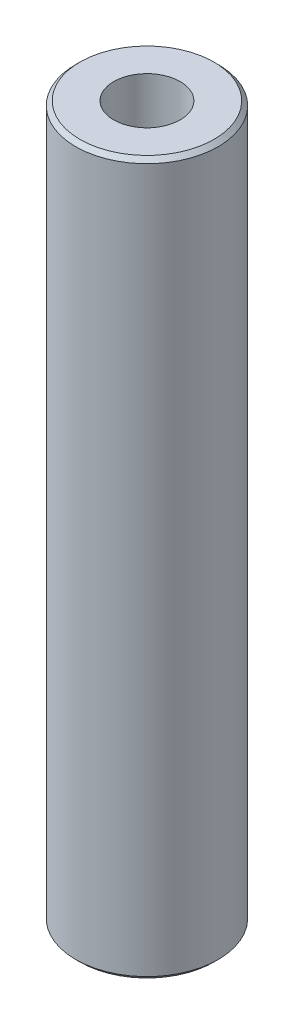
ISO-10303-21;
HEADER;
FILE_DESCRIPTION(('STEP AP214'),'2;1');
FILE_NAME('part.step','',(''),(''),'','','');
FILE_SCHEMA(('AUTOMOTIVE_DESIGN { 1 0 10303 214 1 1 1 1 }'));
ENDSEC;
DATA;
#1=APPLICATION_CONTEXT('core data for automotive mechanical design processes');
#2=APPLICATION_PROTOCOL_DEFINITION('international standard','automotive_design',2000,#1);
#3=PRODUCT_CONTEXT('',#1,'mechanical');
#4=PRODUCT('Part','Part','',(#3));
#5=PRODUCT_RELATED_PRODUCT_CATEGORY('part','',(#4));
#6=PRODUCT_DEFINITION_FORMATION('','',#4);
#7=PRODUCT_DEFINITION_CONTEXT('part definition',#1,'design');
#8=PRODUCT_DEFINITION('design','',#6,#7);
#9=PRODUCT_DEFINITION_SHAPE('','',#8);
#10=(LENGTH_UNIT() NAMED_UNIT(*) SI_UNIT(.MILLI.,.METRE.));
#11=(NAMED_UNIT(*) PLANE_ANGLE_UNIT() SI_UNIT($,.RADIAN.));
#12=(NAMED_UNIT(*) SI_UNIT($,.STERADIAN.) SOLID_ANGLE_UNIT());
#13=UNCERTAINTY_MEASURE_WITH_UNIT(LENGTH_MEASURE(1.E-05),#10,'distance_accuracy_value','');
#14=(GEOMETRIC_REPRESENTATION_CONTEXT(3) GLOBAL_UNCERTAINTY_ASSIGNED_CONTEXT((#13)) GLOBAL_UNIT_ASSIGNED_CONTEXT((#10,
#11,#12)) REPRESENTATION_CONTEXT('',''));
#15=CARTESIAN_POINT('',(0.,0.,0.));
#16=DIRECTION('',(0.,0.,1.));
#17=DIRECTION('',(1.,0.,0.));
#18=AXIS2_PLACEMENT_3D('',#15,#16,#17);
#19=CARTESIAN_POINT('',(0.,600.,0.));
#20=DIRECTION('',(0.,-1.,0.));
#21=DIRECTION('',(0.,0.,-1.));
#22=AXIS2_PLACEMENT_3D('',#19,#20,#21);
#23=CYLINDRICAL_SURFACE('',#22,60.);
#24=CARTESIAN_POINT('',(0.,596.452487027661,0.));
#25=DIRECTION('',(0.,1.,0.));
#26=DIRECTION('',(0.,0.,1.));
#27=AXIS2_PLACEMENT_3D('',#24,#25,#26);
#28=CIRCLE('',#27,60.);
#29=CARTESIAN_POINT('',(0.,596.452487027661,60.));
#30=VERTEX_POINT('',#29);
#31=EDGE_CURVE('E50',#30,#30,#28,.F.);
#32=ORIENTED_EDGE('',*,*,#31,.T.);
#33=EDGE_LOOP('',(#32));
#34=FACE_BOUND('',#33,.T.);
#35=CARTESIAN_POINT('',(0.,3.54751297233902,0.));
#36=DIRECTION('',(0.,1.,0.));
#37=DIRECTION('',(0.,0.,1.));
#38=AXIS2_PLACEMENT_3D('',#35,#36,#37);
#39=CIRCLE('',#38,60.);
#40=CARTESIAN_POINT('',(0.,3.54751297233902,60.));
#41=VERTEX_POINT('',#40);
#42=EDGE_CURVE('E51',#41,#41,#39,.T.);
#43=ORIENTED_EDGE('',*,*,#42,.T.);
#44=EDGE_LOOP('',(#43));
#45=FACE_BOUND('',#44,.T.);
#46=ADVANCED_FACE('F39',(#34,#45),#23,.T.);
#47=CARTESIAN_POINT('',(0.,600.,0.));
#48=DIRECTION('',(0.,1.,0.));
#49=DIRECTION('',(0.,0.,1.));
#50=AXIS2_PLACEMENT_3D('',#47,#48,#49);
#51=PLANE('',#50);
#52=CARTESIAN_POINT('',(0.,600.,0.));
#53=DIRECTION('',(0.,1.,0.));
#54=DIRECTION('',(0.,0.,1.));
#55=AXIS2_PLACEMENT_3D('',#52,#53,#54);
#56=CIRCLE('',#55,56.4524870276609);
#57=CARTESIAN_POINT('',(0.,600.,56.4524870276609));
#58=VERTEX_POINT('',#57);
#59=EDGE_CURVE('E54',#58,#58,#56,.T.);
#60=ORIENTED_EDGE('',*,*,#59,.T.);
#61=EDGE_LOOP('',(#60));
#62=FACE_BOUND('',#61,.T.);
#63=CARTESIAN_POINT('',(0.,600.,0.));
#64=DIRECTION('',(0.,1.,0.));
#65=DIRECTION('',(0.,0.,1.));
#66=AXIS2_PLACEMENT_3D('',#63,#64,#65);
#67=CIRCLE('',#66,27.9817754680077);
#68=CARTESIAN_POINT('',(0.,600.,27.9817754680077));
#69=VERTEX_POINT('',#68);
#70=EDGE_CURVE('E58',#69,#69,#67,.T.);
#71=ORIENTED_EDGE('',*,*,#70,.F.);
#72=EDGE_LOOP('',(#71));
#73=FACE_BOUND('',#72,.T.);
#74=ADVANCED_FACE('F69',(#62,#73),#51,.T.);
#75=CARTESIAN_POINT('',(0.,0.,0.));
#76=DIRECTION('',(0.,1.,0.));
#77=DIRECTION('',(0.,0.,1.));
#78=AXIS2_PLACEMENT_3D('',#75,#76,#77);
#79=PLANE('',#78);
#80=CARTESIAN_POINT('',(0.,0.,0.));
#81=DIRECTION('',(0.,1.,0.));
#82=DIRECTION('',(0.,0.,1.));
#83=AXIS2_PLACEMENT_3D('',#80,#81,#82);
#84=CIRCLE('',#83,56.4524870276609);
#85=CARTESIAN_POINT('',(0.,0.,56.4524870276609));
#86=VERTEX_POINT('',#85);
#87=EDGE_CURVE('E10',#86,#86,#84,.F.);
#88=ORIENTED_EDGE('',*,*,#87,.T.);
#89=EDGE_LOOP('',(#88));
#90=FACE_BOUND('',#89,.T.);
#91=CARTESIAN_POINT('',(0.,0.,0.));
#92=DIRECTION('',(0.,1.,0.));
#93=DIRECTION('',(0.,0.,1.));
#94=AXIS2_PLACEMENT_3D('',#91,#92,#93);
#95=CIRCLE('',#94,27.9817754680077);
#96=CARTESIAN_POINT('',(0.,0.,27.9817754680077));
#97=VERTEX_POINT('',#96);
#98=EDGE_CURVE('E63',#97,#97,#95,.T.);
#99=ORIENTED_EDGE('',*,*,#98,.T.);
#100=EDGE_LOOP('',(#99));
#101=FACE_BOUND('',#100,.T.);
#102=ADVANCED_FACE('F75',(#90,#101),#79,.F.);
#103=CARTESIAN_POINT('',(0.,600.,0.));
#104=DIRECTION('',(0.,-1.,0.));
#105=DIRECTION('',(0.,0.,-1.));
#106=AXIS2_PLACEMENT_3D('',#103,#104,#105);
#107=CYLINDRICAL_SURFACE('',#106,27.9817754680077);
#108=ORIENTED_EDGE('',*,*,#70,.T.);
#109=EDGE_LOOP('',(#108));
#110=FACE_BOUND('',#109,.T.);
#111=ORIENTED_EDGE('',*,*,#98,.F.);
#112=EDGE_LOOP('',(#111));
#113=FACE_BOUND('',#112,.T.);
#114=ADVANCED_FACE('F70',(#110,#113),#107,.F.);
#115=CARTESIAN_POINT('',(0.,600.,0.));
#116=DIRECTION('',(0.,-1.,0.));
#117=DIRECTION('',(0.,0.,-1.));
#118=AXIS2_PLACEMENT_3D('',#115,#116,#117);
#119=CONICAL_SURFACE('',#118,56.4524870276609,0.785398163397441);
#120=ORIENTED_EDGE('',*,*,#31,.F.);
#121=EDGE_LOOP('',(#120));
#122=FACE_BOUND('',#121,.T.);
#123=ORIENTED_EDGE('',*,*,#59,.F.);
#124=EDGE_LOOP('',(#123));
#125=FACE_BOUND('',#124,.T.);
#126=ADVANCED_FACE('F81',(#122,#125),#119,.T.);
#127=CARTESIAN_POINT('',(0.,3.54751297233902,0.));
#128=DIRECTION('',(0.,1.,0.));
#129=DIRECTION('',(0.,0.,1.));
#130=AXIS2_PLACEMENT_3D('',#127,#128,#129);
#131=CONICAL_SURFACE('',#130,60.,0.785398163397456);
#132=CARTESIAN_POINT('',(0.,0.,56.4524870276609));
#133=CARTESIAN_POINT('',(0.,0.0369532601285301,56.4894402877895));
#134=CARTESIAN_POINT('',(0.,0.073906520257062,56.526393547918));
#135=CARTESIAN_POINT('',(0.,0.147813040514126,56.600300068175));
#136=CARTESIAN_POINT('',(0.,0.184766300642658,56.6372533283036));
#137=CARTESIAN_POINT('',(0.,0.25867282089972,56.7111598485606));
#138=CARTESIAN_POINT('',(0.,0.295626081028251,56.7481131086892));
#139=CARTESIAN_POINT('',(0.,0.369532601285313,56.8220196289462));
#140=CARTESIAN_POINT('',(0.,0.406485861413845,56.8589728890748));
#141=CARTESIAN_POINT('',(0.,0.480392381670908,56.9328794093318));
#142=CARTESIAN_POINT('',(0.,0.517345641799439,56.9698326694604));
#143=CARTESIAN_POINT('',(0.,0.591252162056503,57.0437391897174));
#144=CARTESIAN_POINT('',(0.,0.628205422185035,57.080692449846));
#145=CARTESIAN_POINT('',(0.,0.702111942442097,57.154598970103));
#146=CARTESIAN_POINT('',(0.,0.739065202570628,57.1915522302316));
#147=CARTESIAN_POINT('',(0.,0.81297172282769,57.2654587504886));
#148=CARTESIAN_POINT('',(0.,0.849924982956222,57.3024120106172));
#149=CARTESIAN_POINT('',(0.,0.923831503213286,57.3763185308742));
#150=CARTESIAN_POINT('',(0.,0.960784763341817,57.4132717910028));
#151=CARTESIAN_POINT('',(0.,1.03469128359888,57.4871783112598));
#152=CARTESIAN_POINT('',(0.,1.07164454372741,57.5241315713884));
#153=CARTESIAN_POINT('',(0.,1.14555106398447,57.5980380916454));
#154=CARTESIAN_POINT('',(0.,1.182504324113,57.6349913517739));
#155=CARTESIAN_POINT('',(0.,1.25641084437007,57.708897872031));
#156=CARTESIAN_POINT('',(0.,1.2933641044986,57.7458511321596));
#157=CARTESIAN_POINT('',(0.,1.36727062475566,57.8197576524166));
#158=CARTESIAN_POINT('',(0.,1.40422388488419,57.8567109125451));
#159=CARTESIAN_POINT('',(0.,1.47813040514126,57.9306174328022));
#160=CARTESIAN_POINT('',(0.,1.51508366526979,57.9675706929307));
#161=CARTESIAN_POINT('',(0.,1.58899018552685,58.0414772131878));
#162=CARTESIAN_POINT('',(0.,1.62594344565538,58.0784304733163));
#163=CARTESIAN_POINT('',(0.,1.69984996591244,58.1523369935734));
#164=CARTESIAN_POINT('',(0.,1.73680322604098,58.1892902537019));
#165=CARTESIAN_POINT('',(0.,1.81070974629804,58.263196773959));
#166=CARTESIAN_POINT('',(0.,1.84766300642657,58.3001500340875));
#167=CARTESIAN_POINT('',(0.,1.92156952668363,58.3740565543446));
#168=CARTESIAN_POINT('',(0.,1.95852278681217,58.4110098144731));
#169=CARTESIAN_POINT('',(0.,2.03242930706923,58.4849163347302));
#170=CARTESIAN_POINT('',(0.,2.06938256719776,58.5218695948587));
#171=CARTESIAN_POINT('',(0.,2.14328908745482,58.5957761151158));
#172=CARTESIAN_POINT('',(0.,2.18024234758335,58.6327293752443));
#173=CARTESIAN_POINT('',(0.,2.25414886784042,58.7066358955014));
#174=CARTESIAN_POINT('',(0.,2.29110212796895,58.7435891556299));
#175=CARTESIAN_POINT('',(0.,2.36500864822601,58.817495675887));
#176=CARTESIAN_POINT('',(0.,2.40196190835454,58.8544489360155));
#177=CARTESIAN_POINT('',(0.,2.47586842861161,58.9283554562726));
#178=CARTESIAN_POINT('',(0.,2.51282168874014,58.9653087164011));
#179=CARTESIAN_POINT('',(0.,2.5867282089972,59.0392152366582));
#180=CARTESIAN_POINT('',(0.,2.62368146912573,59.0761684967867));
#181=CARTESIAN_POINT('',(0.,2.69758798938279,59.1500750170438));
#182=CARTESIAN_POINT('',(0.,2.73454124951133,59.1870282771723));
#183=CARTESIAN_POINT('',(0.,2.80844776976839,59.2609347974293));
#184=CARTESIAN_POINT('',(0.,2.84540102989692,59.2978880575579));
#185=CARTESIAN_POINT('',(0.,2.91930755015398,59.371794577815));
#186=CARTESIAN_POINT('',(0.,2.95626081028251,59.4087478379435));
#187=CARTESIAN_POINT('',(0.,3.03016733053958,59.4826543582005));
#188=CARTESIAN_POINT('',(0.,3.06712059066811,59.5196076183291));
#189=CARTESIAN_POINT('',(0.,3.14102711092517,59.5935141385861));
#190=CARTESIAN_POINT('',(0.,3.1779803710537,59.6304673987147));
#191=CARTESIAN_POINT('',(0.,3.25188689131077,59.7043739189717));
#192=CARTESIAN_POINT('',(0.,3.2888401514393,59.7413271791003));
#193=CARTESIAN_POINT('',(0.,3.36274667169636,59.8152336993573));
#194=CARTESIAN_POINT('',(0.,3.39969993182489,59.8521869594859));
#195=CARTESIAN_POINT('',(0.,3.47360645208195,59.9260934797429));
#196=CARTESIAN_POINT('',(0.,3.51055971221048,59.9630467398715));
#197=CARTESIAN_POINT('',(0.,3.54751297233902,60.));
#198=B_SPLINE_CURVE_WITH_KNOTS('',3,(#132,#133,#134,#135,#136,#137,#138,#139,#140,#141,#142,
#143,#144,#145,#146,#147,#148,#149,#150,#151,#152,#153,#154,#155,#156,#157,#158,#159,#160,#161,
#162,#163,#164,#165,#166,#167,#168,#169,#170,#171,#172,#173,#174,#175,#176,#177,#178,#179,#180,
#181,#182,#183,#184,#185,#186,#187,#188,#189,#190,#191,#192,#193,#194,#195,#196,#197),
.UNSPECIFIED.,.F.,.F.,(4,2,2,2,2,2,2,2,2,2,2,2,2,2,2,2,2,2,2,2,2,2,2,2,2,2,2,2,2,2,2,2,4),(0.,
0.15677940494301,0.313558809886021,0.470338214829036,0.627117619772046,0.783897024715056,
0.940676429658067,1.09745583460108,1.25423523954409,1.4110146444871,1.56779404943011,
1.72457345437313,1.88135285931614,2.03813226425915,2.19491166920216,2.35169107414517,
2.50847047908818,2.66524988403119,2.8220292889742,2.97880869391722,3.13558809886023,
3.29236750380324,3.44914690874625,3.60592631368927,3.76270571863227,3.91948512357529,
4.0762645285183,4.23304393346131,4.38982333840432,4.54660274334733,4.70338214829034,
4.86016155323336,5.01694095817637),.UNSPECIFIED.);
#199=EDGE_CURVE('BSEAM45',#86,#41,#198,.T.);
#200=ORIENTED_EDGE('',*,*,#87,.F.);
#201=ORIENTED_EDGE('',*,*,#42,.F.);
#202=ORIENTED_EDGE('',*,*,#199,.T.);
#203=ORIENTED_EDGE('',*,*,#199,.F.);
#204=EDGE_LOOP('',(#200,#202,#201,#203));
#205=FACE_BOUND('',#204,.T.);
#206=ADVANCED_FACE('F45',(#205),#131,.T.);
#207=CLOSED_SHELL('',(#46,#74,#102,#114,#126,#206));
#208=MANIFOLD_SOLID_BREP('B2',#207);
#209=ADVANCED_BREP_SHAPE_REPRESENTATION('',(#18,#208),#14);
#210=SHAPE_DEFINITION_REPRESENTATION(#9,#209);
ENDSEC;
END-ISO-10303-21;
